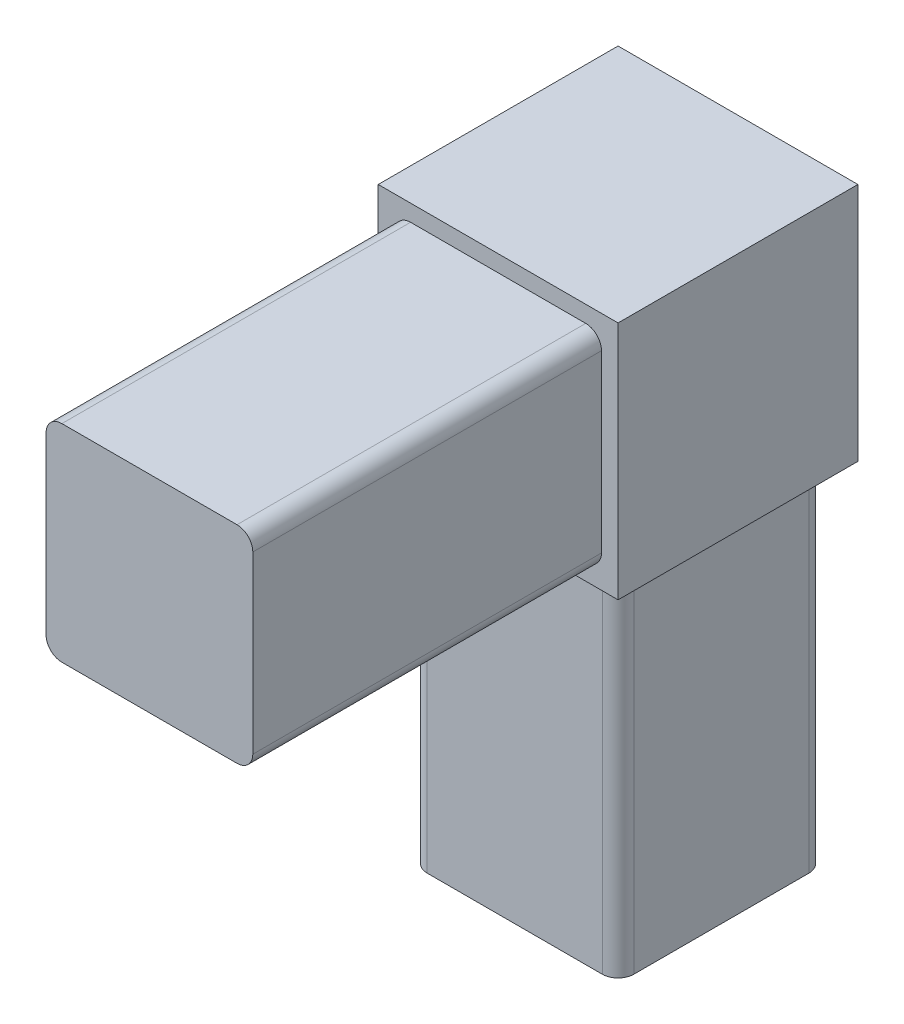
ISO-10303-21;
HEADER;
FILE_DESCRIPTION(('STEP AP214'),'2;1');
FILE_NAME('part.step','',(''),(''),'','','');
FILE_SCHEMA(('AUTOMOTIVE_DESIGN { 1 0 10303 214 1 1 1 1 }'));
ENDSEC;
DATA;
#1=APPLICATION_CONTEXT('core data for automotive mechanical design processes');
#2=APPLICATION_PROTOCOL_DEFINITION('international standard','automotive_design',2000,#1);
#3=PRODUCT_CONTEXT('',#1,'mechanical');
#4=PRODUCT('Part','Part','',(#3));
#5=PRODUCT_RELATED_PRODUCT_CATEGORY('part','',(#4));
#6=PRODUCT_DEFINITION_FORMATION('','',#4);
#7=PRODUCT_DEFINITION_CONTEXT('part definition',#1,'design');
#8=PRODUCT_DEFINITION('design','',#6,#7);
#9=PRODUCT_DEFINITION_SHAPE('','',#8);
#10=(LENGTH_UNIT() NAMED_UNIT(*) SI_UNIT(.MILLI.,.METRE.));
#11=(NAMED_UNIT(*) PLANE_ANGLE_UNIT() SI_UNIT($,.RADIAN.));
#12=(NAMED_UNIT(*) SI_UNIT($,.STERADIAN.) SOLID_ANGLE_UNIT());
#13=UNCERTAINTY_MEASURE_WITH_UNIT(LENGTH_MEASURE(1.E-05),#10,'distance_accuracy_value','');
#14=(GEOMETRIC_REPRESENTATION_CONTEXT(3) GLOBAL_UNCERTAINTY_ASSIGNED_CONTEXT((#13)) GLOBAL_UNIT_ASSIGNED_CONTEXT((#10,
#11,#12)) REPRESENTATION_CONTEXT('',''));
#15=CARTESIAN_POINT('',(0.,0.,0.));
#16=DIRECTION('',(0.,0.,1.));
#17=DIRECTION('',(1.,0.,0.));
#18=AXIS2_PLACEMENT_3D('',#15,#16,#17);
#19=CARTESIAN_POINT('',(-9.652,47.371,9.652));
#20=DIRECTION('',(0.,0.,-1.));
#21=DIRECTION('',(-1.,0.,0.));
#22=AXIS2_PLACEMENT_3D('',#19,#20,#21);
#23=PLANE('',#22);
#24=DIRECTION('',(1.,0.,0.));
#25=VECTOR('',#24,1.);
#26=CARTESIAN_POINT('',(-9.652,28.067,9.652));
#27=LINE('',#26,#25);
#28=CARTESIAN_POINT('',(-9.652,28.067,9.652));
#29=VERTEX_POINT('',#28);
#30=CARTESIAN_POINT('',(9.652,28.067,9.652));
#31=VERTEX_POINT('',#30);
#32=EDGE_CURVE('E192',#29,#31,#27,.T.);
#33=ORIENTED_EDGE('',*,*,#32,.T.);
#34=DIRECTION('',(0.,-1.,0.));
#35=VECTOR('',#34,1.);
#36=CARTESIAN_POINT('',(9.652,47.371,9.652));
#37=LINE('',#36,#35);
#38=CARTESIAN_POINT('',(9.652,47.371,9.652));
#39=VERTEX_POINT('',#38);
#40=EDGE_CURVE('E412',#39,#31,#37,.T.);
#41=ORIENTED_EDGE('',*,*,#40,.F.);
#42=DIRECTION('',(1.,0.,0.));
#43=VECTOR('',#42,1.);
#44=CARTESIAN_POINT('',(-9.652,47.371,9.652));
#45=LINE('',#44,#43);
#46=CARTESIAN_POINT('',(-9.652,47.371,9.652));
#47=VERTEX_POINT('',#46);
#48=EDGE_CURVE('E188',#47,#39,#45,.T.);
#49=ORIENTED_EDGE('',*,*,#48,.F.);
#50=DIRECTION('',(0.,-1.,0.));
#51=VECTOR('',#50,1.);
#52=CARTESIAN_POINT('',(-9.652,47.371,9.652));
#53=LINE('',#52,#51);
#54=EDGE_CURVE('E202',#47,#29,#53,.T.);
#55=ORIENTED_EDGE('',*,*,#54,.T.);
#56=EDGE_LOOP('',(#33,#41,#49,#55));
#57=FACE_BOUND('',#56,.T.);
#58=DIRECTION('',(0.,1.,0.));
#59=VECTOR('',#58,1.);
#60=CARTESIAN_POINT('',(8.3185,29.4005,9.652));
#61=LINE('',#60,#59);
#62=CARTESIAN_POINT('',(8.3185,30.6705,9.652));
#63=VERTEX_POINT('',#62);
#64=CARTESIAN_POINT('',(8.3185,44.7675,9.652));
#65=VERTEX_POINT('',#64);
#66=EDGE_CURVE('E399',#63,#65,#61,.T.);
#67=ORIENTED_EDGE('',*,*,#66,.F.);
#68=CARTESIAN_POINT('',(7.0485,30.6705,9.652));
#69=DIRECTION('',(0.,0.,-1.));
#70=DIRECTION('',(-1.,0.,0.));
#71=AXIS2_PLACEMENT_3D('',#68,#69,#70);
#72=CIRCLE('',#71,1.27);
#73=CARTESIAN_POINT('',(7.0485,29.4005,9.652));
#74=VERTEX_POINT('',#73);
#75=EDGE_CURVE('E280',#63,#74,#72,.T.);
#76=ORIENTED_EDGE('',*,*,#75,.T.);
#77=DIRECTION('',(1.,0.,0.));
#78=VECTOR('',#77,1.);
#79=CARTESIAN_POINT('',(-8.3185,29.4005,9.652));
#80=LINE('',#79,#78);
#81=CARTESIAN_POINT('',(-7.0485,29.4005,9.652));
#82=VERTEX_POINT('',#81);
#83=EDGE_CURVE('E407',#82,#74,#80,.T.);
#84=ORIENTED_EDGE('',*,*,#83,.F.);
#85=CARTESIAN_POINT('',(-7.0485,30.6705,9.652));
#86=DIRECTION('',(0.,0.,-1.));
#87=DIRECTION('',(-1.,0.,0.));
#88=AXIS2_PLACEMENT_3D('',#85,#86,#87);
#89=CIRCLE('',#88,1.27);
#90=CARTESIAN_POINT('',(-8.3185,30.6705,9.652));
#91=VERTEX_POINT('',#90);
#92=EDGE_CURVE('E284',#82,#91,#89,.T.);
#93=ORIENTED_EDGE('',*,*,#92,.T.);
#94=DIRECTION('',(0.,-1.,0.));
#95=VECTOR('',#94,1.);
#96=CARTESIAN_POINT('',(-8.3185,29.4005,9.652));
#97=LINE('',#96,#95);
#98=CARTESIAN_POINT('',(-8.3185,44.7675,9.652));
#99=VERTEX_POINT('',#98);
#100=EDGE_CURVE('E405',#99,#91,#97,.T.);
#101=ORIENTED_EDGE('',*,*,#100,.F.);
#102=CARTESIAN_POINT('',(-7.0485,44.7675,9.652));
#103=DIRECTION('',(0.,0.,-1.));
#104=DIRECTION('',(-1.,0.,0.));
#105=AXIS2_PLACEMENT_3D('',#102,#103,#104);
#106=CIRCLE('',#105,1.27);
#107=CARTESIAN_POINT('',(-7.0485,46.0375,9.652));
#108=VERTEX_POINT('',#107);
#109=EDGE_CURVE('E282',#99,#108,#106,.T.);
#110=ORIENTED_EDGE('',*,*,#109,.T.);
#111=DIRECTION('',(-1.,0.,0.));
#112=VECTOR('',#111,1.);
#113=CARTESIAN_POINT('',(-8.3185,46.0375,9.652));
#114=LINE('',#113,#112);
#115=CARTESIAN_POINT('',(7.0485,46.0375,9.652));
#116=VERTEX_POINT('',#115);
#117=EDGE_CURVE('E402',#116,#108,#114,.T.);
#118=ORIENTED_EDGE('',*,*,#117,.F.);
#119=CARTESIAN_POINT('',(7.0485,44.7675,9.652));
#120=DIRECTION('',(0.,0.,-1.));
#121=DIRECTION('',(-1.,0.,0.));
#122=AXIS2_PLACEMENT_3D('',#119,#120,#121);
#123=CIRCLE('',#122,1.27);
#124=EDGE_CURVE('E278',#116,#65,#123,.T.);
#125=ORIENTED_EDGE('',*,*,#124,.T.);
#126=EDGE_LOOP('',(#67,#76,#84,#93,#101,#110,#118,#125));
#127=FACE_BOUND('',#126,.T.);
#128=ADVANCED_FACE('F35',(#57,#127),#23,.F.);
#129=CARTESIAN_POINT('',(8.3185,28.067,-8.3185));
#130=DIRECTION('',(-1.,0.,0.));
#131=DIRECTION('',(0.,0.,1.));
#132=AXIS2_PLACEMENT_3D('',#129,#130,#131);
#133=PLANE('',#132);
#134=DIRECTION('',(0.,0.,-1.));
#135=VECTOR('',#134,1.);
#136=CARTESIAN_POINT('',(8.3185,28.067,-8.3185));
#137=LINE('',#136,#135);
#138=CARTESIAN_POINT('',(8.3185,28.067,7.0485));
#139=VERTEX_POINT('',#138);
#140=CARTESIAN_POINT('',(8.3185,28.067,-7.0485));
#141=VERTEX_POINT('',#140);
#142=EDGE_CURVE('E206',#139,#141,#137,.T.);
#143=ORIENTED_EDGE('',*,*,#142,.F.);
#144=DIRECTION('',(0.,-1.,0.));
#145=VECTOR('',#144,1.);
#146=CARTESIAN_POINT('',(8.3185,28.067,7.0485));
#147=LINE('',#146,#145);
#148=CARTESIAN_POINT('',(8.3185,0.,7.0485));
#149=VERTEX_POINT('',#148);
#150=EDGE_CURVE('E271',#139,#149,#147,.T.);
#151=ORIENTED_EDGE('',*,*,#150,.T.);
#152=DIRECTION('',(0.,0.,-1.));
#153=VECTOR('',#152,1.);
#154=CARTESIAN_POINT('',(8.3185,0.,-8.3185));
#155=LINE('',#154,#153);
#156=CARTESIAN_POINT('',(8.3185,0.,-7.0485));
#157=VERTEX_POINT('',#156);
#158=EDGE_CURVE('E197',#149,#157,#155,.T.);
#159=ORIENTED_EDGE('',*,*,#158,.T.);
#160=DIRECTION('',(0.,-1.,0.));
#161=VECTOR('',#160,1.);
#162=CARTESIAN_POINT('',(8.3185,28.067,-7.0485));
#163=LINE('',#162,#161);
#164=EDGE_CURVE('E269',#157,#141,#163,.F.);
#165=ORIENTED_EDGE('',*,*,#164,.T.);
#166=EDGE_LOOP('',(#143,#151,#159,#165));
#167=FACE_BOUND('',#166,.T.);
#168=ADVANCED_FACE('F311',(#167),#133,.F.);
#169=CARTESIAN_POINT('',(-8.3185,28.067,-8.3185));
#170=DIRECTION('',(0.,0.,1.));
#171=DIRECTION('',(1.,0.,0.));
#172=AXIS2_PLACEMENT_3D('',#169,#170,#171);
#173=PLANE('',#172);
#174=DIRECTION('',(-1.,0.,0.));
#175=VECTOR('',#174,1.);
#176=CARTESIAN_POINT('',(-8.3185,0.,-8.3185));
#177=LINE('',#176,#175);
#178=CARTESIAN_POINT('',(7.0485,0.,-8.3185));
#179=VERTEX_POINT('',#178);
#180=CARTESIAN_POINT('',(-7.0485,0.,-8.3185));
#181=VERTEX_POINT('',#180);
#182=EDGE_CURVE('E200',#179,#181,#177,.T.);
#183=ORIENTED_EDGE('',*,*,#182,.T.);
#184=DIRECTION('',(0.,-1.,0.));
#185=VECTOR('',#184,1.);
#186=CARTESIAN_POINT('',(-7.0485,28.067,-8.3185));
#187=LINE('',#186,#185);
#188=CARTESIAN_POINT('',(-7.0485,28.067,-8.3185));
#189=VERTEX_POINT('',#188);
#190=EDGE_CURVE('E50',#181,#189,#187,.F.);
#191=ORIENTED_EDGE('',*,*,#190,.T.);
#192=DIRECTION('',(-1.,0.,0.));
#193=VECTOR('',#192,1.);
#194=CARTESIAN_POINT('',(-8.3185,28.067,-8.3185));
#195=LINE('',#194,#193);
#196=CARTESIAN_POINT('',(7.0485,28.067,-8.3185));
#197=VERTEX_POINT('',#196);
#198=EDGE_CURVE('E208',#197,#189,#195,.T.);
#199=ORIENTED_EDGE('',*,*,#198,.F.);
#200=DIRECTION('',(0.,-1.,0.));
#201=VECTOR('',#200,1.);
#202=CARTESIAN_POINT('',(7.0485,28.067,-8.3185));
#203=LINE('',#202,#201);
#204=EDGE_CURVE('E274',#197,#179,#203,.T.);
#205=ORIENTED_EDGE('',*,*,#204,.T.);
#206=EDGE_LOOP('',(#183,#191,#199,#205));
#207=FACE_BOUND('',#206,.T.);
#208=ADVANCED_FACE('F304',(#207),#173,.F.);
#209=CARTESIAN_POINT('',(-8.3185,28.067,-8.3185));
#210=DIRECTION('',(1.,0.,0.));
#211=DIRECTION('',(0.,0.,-1.));
#212=AXIS2_PLACEMENT_3D('',#209,#210,#211);
#213=PLANE('',#212);
#214=DIRECTION('',(0.,0.,1.));
#215=VECTOR('',#214,1.);
#216=CARTESIAN_POINT('',(-8.3185,0.,-8.3185));
#217=LINE('',#216,#215);
#218=CARTESIAN_POINT('',(-8.3185,0.,-7.0485));
#219=VERTEX_POINT('',#218);
#220=CARTESIAN_POINT('',(-8.3185,0.,7.0485));
#221=VERTEX_POINT('',#220);
#222=EDGE_CURVE('E219',#219,#221,#217,.T.);
#223=ORIENTED_EDGE('',*,*,#222,.T.);
#224=DIRECTION('',(0.,-1.,0.));
#225=VECTOR('',#224,1.);
#226=CARTESIAN_POINT('',(-8.3185,28.067,7.0485));
#227=LINE('',#226,#225);
#228=CARTESIAN_POINT('',(-8.3185,28.067,7.0485));
#229=VERTEX_POINT('',#228);
#230=EDGE_CURVE('E267',#221,#229,#227,.F.);
#231=ORIENTED_EDGE('',*,*,#230,.T.);
#232=DIRECTION('',(0.,0.,1.));
#233=VECTOR('',#232,1.);
#234=CARTESIAN_POINT('',(-8.3185,28.067,-8.3185));
#235=LINE('',#234,#233);
#236=CARTESIAN_POINT('',(-8.3185,28.067,-7.0485));
#237=VERTEX_POINT('',#236);
#238=EDGE_CURVE('E211',#237,#229,#235,.T.);
#239=ORIENTED_EDGE('',*,*,#238,.F.);
#240=DIRECTION('',(0.,-1.,0.));
#241=VECTOR('',#240,1.);
#242=CARTESIAN_POINT('',(-8.3185,28.067,-7.0485));
#243=LINE('',#242,#241);
#244=EDGE_CURVE('E264',#237,#219,#243,.T.);
#245=ORIENTED_EDGE('',*,*,#244,.T.);
#246=EDGE_LOOP('',(#223,#231,#239,#245));
#247=FACE_BOUND('',#246,.T.);
#248=ADVANCED_FACE('F296',(#247),#213,.F.);
#249=CARTESIAN_POINT('',(-8.3185,28.067,8.3185));
#250=DIRECTION('',(0.,0.,-1.));
#251=DIRECTION('',(-1.,0.,0.));
#252=AXIS2_PLACEMENT_3D('',#249,#250,#251);
#253=PLANE('',#252);
#254=DIRECTION('',(1.,0.,0.));
#255=VECTOR('',#254,1.);
#256=CARTESIAN_POINT('',(-8.3185,28.067,8.3185));
#257=LINE('',#256,#255);
#258=CARTESIAN_POINT('',(-7.0485,28.067,8.3185));
#259=VERTEX_POINT('',#258);
#260=CARTESIAN_POINT('',(7.0485,28.067,8.3185));
#261=VERTEX_POINT('',#260);
#262=EDGE_CURVE('E214',#259,#261,#257,.T.);
#263=ORIENTED_EDGE('',*,*,#262,.F.);
#264=DIRECTION('',(0.,-1.,0.));
#265=VECTOR('',#264,1.);
#266=CARTESIAN_POINT('',(-7.0485,28.067,8.3185));
#267=LINE('',#266,#265);
#268=CARTESIAN_POINT('',(-7.0485,0.,8.3185));
#269=VERTEX_POINT('',#268);
#270=EDGE_CURVE('E253',#259,#269,#267,.T.);
#271=ORIENTED_EDGE('',*,*,#270,.T.);
#272=DIRECTION('',(1.,0.,0.));
#273=VECTOR('',#272,1.);
#274=CARTESIAN_POINT('',(-8.3185,0.,8.3185));
#275=LINE('',#274,#273);
#276=CARTESIAN_POINT('',(7.0485,0.,8.3185));
#277=VERTEX_POINT('',#276);
#278=EDGE_CURVE('E209',#269,#277,#275,.T.);
#279=ORIENTED_EDGE('',*,*,#278,.T.);
#280=DIRECTION('',(0.,-1.,0.));
#281=VECTOR('',#280,1.);
#282=CARTESIAN_POINT('',(7.0485,28.067,8.3185));
#283=LINE('',#282,#281);
#284=EDGE_CURVE('E251',#277,#261,#283,.F.);
#285=ORIENTED_EDGE('',*,*,#284,.T.);
#286=EDGE_LOOP('',(#263,#271,#279,#285));
#287=FACE_BOUND('',#286,.T.);
#288=ADVANCED_FACE('F319',(#287),#253,.F.);
#289=CARTESIAN_POINT('',(0.,0.,0.));
#290=DIRECTION('',(0.,1.,0.));
#291=DIRECTION('',(0.,0.,1.));
#292=AXIS2_PLACEMENT_3D('',#289,#290,#291);
#293=PLANE('',#292);
#294=ORIENTED_EDGE('',*,*,#278,.F.);
#295=CARTESIAN_POINT('',(-7.0485,0.,7.0485));
#296=DIRECTION('',(0.,1.,0.));
#297=DIRECTION('',(0.,0.,1.));
#298=AXIS2_PLACEMENT_3D('',#295,#296,#297);
#299=CIRCLE('',#298,1.27);
#300=EDGE_CURVE('E262',#269,#221,#299,.F.);
#301=ORIENTED_EDGE('',*,*,#300,.T.);
#302=ORIENTED_EDGE('',*,*,#222,.F.);
#303=CARTESIAN_POINT('',(-7.0485,0.,-7.0485));
#304=DIRECTION('',(0.,1.,0.));
#305=DIRECTION('',(0.,0.,1.));
#306=AXIS2_PLACEMENT_3D('',#303,#304,#305);
#307=CIRCLE('',#306,1.27);
#308=EDGE_CURVE('E258',#219,#181,#307,.F.);
#309=ORIENTED_EDGE('',*,*,#308,.T.);
#310=ORIENTED_EDGE('',*,*,#182,.F.);
#311=CARTESIAN_POINT('',(7.0485,0.,-7.0485));
#312=DIRECTION('',(0.,1.,0.));
#313=DIRECTION('',(0.,0.,1.));
#314=AXIS2_PLACEMENT_3D('',#311,#312,#313);
#315=CIRCLE('',#314,1.27);
#316=EDGE_CURVE('E256',#179,#157,#315,.F.);
#317=ORIENTED_EDGE('',*,*,#316,.T.);
#318=ORIENTED_EDGE('',*,*,#158,.F.);
#319=CARTESIAN_POINT('',(7.0485,0.,7.0485));
#320=DIRECTION('',(0.,1.,0.));
#321=DIRECTION('',(0.,0.,1.));
#322=AXIS2_PLACEMENT_3D('',#319,#320,#321);
#323=CIRCLE('',#322,1.27);
#324=EDGE_CURVE('E260',#149,#277,#323,.F.);
#325=ORIENTED_EDGE('',*,*,#324,.T.);
#326=EDGE_LOOP('',(#294,#301,#302,#309,#310,#317,#318,#325));
#327=FACE_BOUND('',#326,.T.);
#328=ADVANCED_FACE('F303',(#327),#293,.F.);
#329=CARTESIAN_POINT('',(0.,28.067,0.));
#330=DIRECTION('',(0.,-1.,0.));
#331=DIRECTION('',(0.,0.,-1.));
#332=AXIS2_PLACEMENT_3D('',#329,#330,#331);
#333=PLANE('',#332);
#334=DIRECTION('',(0.,0.,-1.));
#335=VECTOR('',#334,1.);
#336=CARTESIAN_POINT('',(9.652,28.067,9.652));
#337=LINE('',#336,#335);
#338=CARTESIAN_POINT('',(9.652,28.067,-9.652));
#339=VERTEX_POINT('',#338);
#340=EDGE_CURVE('E196',#31,#339,#337,.T.);
#341=ORIENTED_EDGE('',*,*,#340,.F.);
#342=ORIENTED_EDGE('',*,*,#32,.F.);
#343=DIRECTION('',(0.,0.,1.));
#344=VECTOR('',#343,1.);
#345=CARTESIAN_POINT('',(-9.652,28.067,9.652));
#346=LINE('',#345,#344);
#347=CARTESIAN_POINT('',(-9.652,28.067,-9.652));
#348=VERTEX_POINT('',#347);
#349=EDGE_CURVE('E416',#348,#29,#346,.T.);
#350=ORIENTED_EDGE('',*,*,#349,.F.);
#351=DIRECTION('',(-1.,0.,0.));
#352=VECTOR('',#351,1.);
#353=CARTESIAN_POINT('',(-9.652,28.067,-9.652));
#354=LINE('',#353,#352);
#355=EDGE_CURVE('E414',#339,#348,#354,.T.);
#356=ORIENTED_EDGE('',*,*,#355,.F.);
#357=EDGE_LOOP('',(#341,#342,#350,#356));
#358=FACE_BOUND('',#357,.T.);
#359=ORIENTED_EDGE('',*,*,#262,.T.);
#360=CARTESIAN_POINT('',(7.0485,28.067,7.0485));
#361=DIRECTION('',(0.,-1.,0.));
#362=DIRECTION('',(0.,0.,-1.));
#363=AXIS2_PLACEMENT_3D('',#360,#361,#362);
#364=CIRCLE('',#363,1.27);
#365=EDGE_CURVE('E288',#261,#139,#364,.F.);
#366=ORIENTED_EDGE('',*,*,#365,.T.);
#367=ORIENTED_EDGE('',*,*,#142,.T.);
#368=CARTESIAN_POINT('',(7.0485,28.067,-7.0485));
#369=DIRECTION('',(0.,-1.,0.));
#370=DIRECTION('',(0.,0.,-1.));
#371=AXIS2_PLACEMENT_3D('',#368,#369,#370);
#372=CIRCLE('',#371,1.27);
#373=EDGE_CURVE('E11',#141,#197,#372,.F.);
#374=ORIENTED_EDGE('',*,*,#373,.T.);
#375=ORIENTED_EDGE('',*,*,#198,.T.);
#376=CARTESIAN_POINT('',(-7.0485,28.067,-7.0485));
#377=DIRECTION('',(0.,-1.,0.));
#378=DIRECTION('',(0.,0.,-1.));
#379=AXIS2_PLACEMENT_3D('',#376,#377,#378);
#380=CIRCLE('',#379,1.27);
#381=EDGE_CURVE('E43',#189,#237,#380,.F.);
#382=ORIENTED_EDGE('',*,*,#381,.T.);
#383=ORIENTED_EDGE('',*,*,#238,.T.);
#384=CARTESIAN_POINT('',(-7.0485,28.067,7.0485));
#385=DIRECTION('',(0.,-1.,0.));
#386=DIRECTION('',(0.,0.,-1.));
#387=AXIS2_PLACEMENT_3D('',#384,#385,#386);
#388=CIRCLE('',#387,1.27);
#389=EDGE_CURVE('E286',#229,#259,#388,.F.);
#390=ORIENTED_EDGE('',*,*,#389,.T.);
#391=EDGE_LOOP('',(#359,#366,#367,#374,#375,#382,#383,#390));
#392=FACE_BOUND('',#391,.T.);
#393=ADVANCED_FACE('F291',(#358,#392),#333,.T.);
#394=CARTESIAN_POINT('',(9.652,47.371,9.652));
#395=DIRECTION('',(-1.,0.,0.));
#396=DIRECTION('',(0.,0.,1.));
#397=AXIS2_PLACEMENT_3D('',#394,#395,#396);
#398=PLANE('',#397);
#399=ORIENTED_EDGE('',*,*,#340,.T.);
#400=DIRECTION('',(0.,-1.,0.));
#401=VECTOR('',#400,1.);
#402=CARTESIAN_POINT('',(9.652,47.371,-9.652));
#403=LINE('',#402,#401);
#404=CARTESIAN_POINT('',(9.652,47.371,-9.652));
#405=VERTEX_POINT('',#404);
#406=EDGE_CURVE('E176',#405,#339,#403,.T.);
#407=ORIENTED_EDGE('',*,*,#406,.F.);
#408=DIRECTION('',(0.,0.,-1.));
#409=VECTOR('',#408,1.);
#410=CARTESIAN_POINT('',(9.652,47.371,9.652));
#411=LINE('',#410,#409);
#412=EDGE_CURVE('E183',#39,#405,#411,.T.);
#413=ORIENTED_EDGE('',*,*,#412,.F.);
#414=ORIENTED_EDGE('',*,*,#40,.T.);
#415=EDGE_LOOP('',(#399,#407,#413,#414));
#416=FACE_BOUND('',#415,.T.);
#417=ADVANCED_FACE('F194',(#416),#398,.F.);
#418=CARTESIAN_POINT('',(-9.652,47.371,-9.652));
#419=DIRECTION('',(0.,0.,1.));
#420=DIRECTION('',(1.,0.,0.));
#421=AXIS2_PLACEMENT_3D('',#418,#419,#420);
#422=PLANE('',#421);
#423=ORIENTED_EDGE('',*,*,#355,.T.);
#424=DIRECTION('',(0.,-1.,0.));
#425=VECTOR('',#424,1.);
#426=CARTESIAN_POINT('',(-9.652,47.371,-9.652));
#427=LINE('',#426,#425);
#428=CARTESIAN_POINT('',(-9.652,47.371,-9.652));
#429=VERTEX_POINT('',#428);
#430=EDGE_CURVE('E179',#429,#348,#427,.T.);
#431=ORIENTED_EDGE('',*,*,#430,.F.);
#432=DIRECTION('',(-1.,0.,0.));
#433=VECTOR('',#432,1.);
#434=CARTESIAN_POINT('',(-9.652,47.371,-9.652));
#435=LINE('',#434,#433);
#436=EDGE_CURVE('E172',#405,#429,#435,.T.);
#437=ORIENTED_EDGE('',*,*,#436,.F.);
#438=ORIENTED_EDGE('',*,*,#406,.T.);
#439=EDGE_LOOP('',(#423,#431,#437,#438));
#440=FACE_BOUND('',#439,.T.);
#441=ADVANCED_FACE('F174',(#440),#422,.F.);
#442=CARTESIAN_POINT('',(-9.652,47.371,9.652));
#443=DIRECTION('',(1.,0.,0.));
#444=DIRECTION('',(0.,0.,-1.));
#445=AXIS2_PLACEMENT_3D('',#442,#443,#444);
#446=PLANE('',#445);
#447=ORIENTED_EDGE('',*,*,#349,.T.);
#448=ORIENTED_EDGE('',*,*,#54,.F.);
#449=DIRECTION('',(0.,0.,1.));
#450=VECTOR('',#449,1.);
#451=CARTESIAN_POINT('',(-9.652,47.371,9.652));
#452=LINE('',#451,#450);
#453=EDGE_CURVE('E182',#429,#47,#452,.T.);
#454=ORIENTED_EDGE('',*,*,#453,.F.);
#455=ORIENTED_EDGE('',*,*,#430,.T.);
#456=EDGE_LOOP('',(#447,#448,#454,#455));
#457=FACE_BOUND('',#456,.T.);
#458=ADVANCED_FACE('F345',(#457),#446,.F.);
#459=CARTESIAN_POINT('',(0.,47.371,0.));
#460=DIRECTION('',(0.,-1.,0.));
#461=DIRECTION('',(0.,0.,-1.));
#462=AXIS2_PLACEMENT_3D('',#459,#460,#461);
#463=PLANE('',#462);
#464=ORIENTED_EDGE('',*,*,#412,.T.);
#465=ORIENTED_EDGE('',*,*,#436,.T.);
#466=ORIENTED_EDGE('',*,*,#453,.T.);
#467=ORIENTED_EDGE('',*,*,#48,.T.);
#468=EDGE_LOOP('',(#464,#465,#466,#467));
#469=FACE_BOUND('',#468,.T.);
#470=ADVANCED_FACE('F186',(#469),#463,.F.);
#471=CARTESIAN_POINT('',(8.3185,29.4005,37.719));
#472=DIRECTION('',(-1.,0.,0.));
#473=DIRECTION('',(0.,0.,1.));
#474=AXIS2_PLACEMENT_3D('',#471,#472,#473);
#475=PLANE('',#474);
#476=ORIENTED_EDGE('',*,*,#66,.T.);
#477=DIRECTION('',(0.,0.,-1.));
#478=VECTOR('',#477,1.);
#479=CARTESIAN_POINT('',(8.3185,44.7675,37.719));
#480=LINE('',#479,#478);
#481=CARTESIAN_POINT('',(8.3185,44.7675,37.719));
#482=VERTEX_POINT('',#481);
#483=EDGE_CURVE('E231',#65,#482,#480,.F.);
#484=ORIENTED_EDGE('',*,*,#483,.T.);
#485=DIRECTION('',(0.,1.,0.));
#486=VECTOR('',#485,1.);
#487=CARTESIAN_POINT('',(8.3185,29.4005,37.719));
#488=LINE('',#487,#486);
#489=CARTESIAN_POINT('',(8.3185,30.6705,37.719));
#490=VERTEX_POINT('',#489);
#491=EDGE_CURVE('E395',#490,#482,#488,.T.);
#492=ORIENTED_EDGE('',*,*,#491,.F.);
#493=DIRECTION('',(0.,0.,-1.));
#494=VECTOR('',#493,1.);
#495=CARTESIAN_POINT('',(8.3185,30.6705,37.719));
#496=LINE('',#495,#494);
#497=EDGE_CURVE('E228',#490,#63,#496,.T.);
#498=ORIENTED_EDGE('',*,*,#497,.T.);
#499=EDGE_LOOP('',(#476,#484,#492,#498));
#500=FACE_BOUND('',#499,.T.);
#501=ADVANCED_FACE('F447',(#500),#475,.F.);
#502=CARTESIAN_POINT('',(-8.3185,46.0375,37.719));
#503=DIRECTION('',(0.,-1.,0.));
#504=DIRECTION('',(0.,0.,-1.));
#505=AXIS2_PLACEMENT_3D('',#502,#503,#504);
#506=PLANE('',#505);
#507=DIRECTION('',(-1.,0.,0.));
#508=VECTOR('',#507,1.);
#509=CARTESIAN_POINT('',(-8.3185,46.0375,37.719));
#510=LINE('',#509,#508);
#511=CARTESIAN_POINT('',(7.0485,46.0375,37.719));
#512=VERTEX_POINT('',#511);
#513=CARTESIAN_POINT('',(-7.0485,46.0375,37.719));
#514=VERTEX_POINT('',#513);
#515=EDGE_CURVE('E385',#512,#514,#510,.T.);
#516=ORIENTED_EDGE('',*,*,#515,.F.);
#517=DIRECTION('',(0.,0.,-1.));
#518=VECTOR('',#517,1.);
#519=CARTESIAN_POINT('',(7.0485,46.0375,37.719));
#520=LINE('',#519,#518);
#521=EDGE_CURVE('E225',#512,#116,#520,.T.);
#522=ORIENTED_EDGE('',*,*,#521,.T.);
#523=ORIENTED_EDGE('',*,*,#117,.T.);
#524=DIRECTION('',(0.,0.,-1.));
#525=VECTOR('',#524,1.);
#526=CARTESIAN_POINT('',(-7.0485,46.0375,37.719));
#527=LINE('',#526,#525);
#528=EDGE_CURVE('E216',#108,#514,#527,.F.);
#529=ORIENTED_EDGE('',*,*,#528,.T.);
#530=EDGE_LOOP('',(#516,#522,#523,#529));
#531=FACE_BOUND('',#530,.T.);
#532=ADVANCED_FACE('F453',(#531),#506,.F.);
#533=CARTESIAN_POINT('',(-8.3185,29.4005,37.719));
#534=DIRECTION('',(1.,0.,0.));
#535=DIRECTION('',(0.,0.,-1.));
#536=AXIS2_PLACEMENT_3D('',#533,#534,#535);
#537=PLANE('',#536);
#538=DIRECTION('',(0.,-1.,0.));
#539=VECTOR('',#538,1.);
#540=CARTESIAN_POINT('',(-8.3185,29.4005,37.719));
#541=LINE('',#540,#539);
#542=CARTESIAN_POINT('',(-8.3185,44.7675,37.719));
#543=VERTEX_POINT('',#542);
#544=CARTESIAN_POINT('',(-8.3185,30.6705,37.719));
#545=VERTEX_POINT('',#544);
#546=EDGE_CURVE('E382',#543,#545,#541,.T.);
#547=ORIENTED_EDGE('',*,*,#546,.F.);
#548=DIRECTION('',(0.,0.,-1.));
#549=VECTOR('',#548,1.);
#550=CARTESIAN_POINT('',(-8.3185,44.7675,37.719));
#551=LINE('',#550,#549);
#552=EDGE_CURVE('E248',#543,#99,#551,.T.);
#553=ORIENTED_EDGE('',*,*,#552,.T.);
#554=ORIENTED_EDGE('',*,*,#100,.T.);
#555=DIRECTION('',(0.,0.,-1.));
#556=VECTOR('',#555,1.);
#557=CARTESIAN_POINT('',(-8.3185,30.6705,37.719));
#558=LINE('',#557,#556);
#559=EDGE_CURVE('E246',#91,#545,#558,.F.);
#560=ORIENTED_EDGE('',*,*,#559,.T.);
#561=EDGE_LOOP('',(#547,#553,#554,#560));
#562=FACE_BOUND('',#561,.T.);
#563=ADVANCED_FACE('F387',(#562),#537,.F.);
#564=CARTESIAN_POINT('',(-8.3185,29.4005,37.719));
#565=DIRECTION('',(0.,1.,0.));
#566=DIRECTION('',(0.,0.,1.));
#567=AXIS2_PLACEMENT_3D('',#564,#565,#566);
#568=PLANE('',#567);
#569=ORIENTED_EDGE('',*,*,#83,.T.);
#570=DIRECTION('',(0.,0.,-1.));
#571=VECTOR('',#570,1.);
#572=CARTESIAN_POINT('',(7.0485,29.4005,37.719));
#573=LINE('',#572,#571);
#574=CARTESIAN_POINT('',(7.0485,29.4005,37.719));
#575=VERTEX_POINT('',#574);
#576=EDGE_CURVE('E244',#74,#575,#573,.F.);
#577=ORIENTED_EDGE('',*,*,#576,.T.);
#578=DIRECTION('',(1.,0.,0.));
#579=VECTOR('',#578,1.);
#580=CARTESIAN_POINT('',(-8.3185,29.4005,37.719));
#581=LINE('',#580,#579);
#582=CARTESIAN_POINT('',(-7.0485,29.4005,37.719));
#583=VERTEX_POINT('',#582);
#584=EDGE_CURVE('E391',#583,#575,#581,.T.);
#585=ORIENTED_EDGE('',*,*,#584,.F.);
#586=DIRECTION('',(0.,0.,-1.));
#587=VECTOR('',#586,1.);
#588=CARTESIAN_POINT('',(-7.0485,29.4005,37.719));
#589=LINE('',#588,#587);
#590=EDGE_CURVE('E241',#583,#82,#589,.T.);
#591=ORIENTED_EDGE('',*,*,#590,.T.);
#592=EDGE_LOOP('',(#569,#577,#585,#591));
#593=FACE_BOUND('',#592,.T.);
#594=ADVANCED_FACE('F468',(#593),#568,.F.);
#595=CARTESIAN_POINT('',(0.,0.,37.719));
#596=DIRECTION('',(0.,0.,-1.));
#597=DIRECTION('',(-1.,0.,0.));
#598=AXIS2_PLACEMENT_3D('',#595,#596,#597);
#599=PLANE('',#598);
#600=ORIENTED_EDGE('',*,*,#491,.T.);
#601=CARTESIAN_POINT('',(7.0485,44.7675,37.719));
#602=DIRECTION('',(0.,0.,-1.));
#603=DIRECTION('',(-1.,0.,0.));
#604=AXIS2_PLACEMENT_3D('',#601,#602,#603);
#605=CIRCLE('',#604,1.27);
#606=EDGE_CURVE('E239',#482,#512,#605,.F.);
#607=ORIENTED_EDGE('',*,*,#606,.T.);
#608=ORIENTED_EDGE('',*,*,#515,.T.);
#609=CARTESIAN_POINT('',(-7.0485,44.7675,37.719));
#610=DIRECTION('',(0.,0.,-1.));
#611=DIRECTION('',(-1.,0.,0.));
#612=AXIS2_PLACEMENT_3D('',#609,#610,#611);
#613=CIRCLE('',#612,1.27);
#614=EDGE_CURVE('E235',#514,#543,#613,.F.);
#615=ORIENTED_EDGE('',*,*,#614,.T.);
#616=ORIENTED_EDGE('',*,*,#546,.T.);
#617=CARTESIAN_POINT('',(-7.0485,30.6705,37.719));
#618=DIRECTION('',(0.,0.,-1.));
#619=DIRECTION('',(-1.,0.,0.));
#620=AXIS2_PLACEMENT_3D('',#617,#618,#619);
#621=CIRCLE('',#620,1.27);
#622=EDGE_CURVE('E233',#545,#583,#621,.F.);
#623=ORIENTED_EDGE('',*,*,#622,.T.);
#624=ORIENTED_EDGE('',*,*,#584,.T.);
#625=CARTESIAN_POINT('',(7.0485,30.6705,37.719));
#626=DIRECTION('',(0.,0.,-1.));
#627=DIRECTION('',(-1.,0.,0.));
#628=AXIS2_PLACEMENT_3D('',#625,#626,#627);
#629=CIRCLE('',#628,1.27);
#630=EDGE_CURVE('E237',#575,#490,#629,.F.);
#631=ORIENTED_EDGE('',*,*,#630,.T.);
#632=EDGE_LOOP('',(#600,#607,#608,#615,#616,#623,#624,#631));
#633=FACE_BOUND('',#632,.T.);
#634=ADVANCED_FACE('F365',(#633),#599,.F.);
#635=CARTESIAN_POINT('',(7.0485,44.7675,37.719));
#636=DIRECTION('',(0.,0.,-1.));
#637=DIRECTION('',(-1.,0.,0.));
#638=AXIS2_PLACEMENT_3D('',#635,#636,#637);
#639=CYLINDRICAL_SURFACE('',#638,1.27);
#640=ORIENTED_EDGE('',*,*,#606,.F.);
#641=ORIENTED_EDGE('',*,*,#483,.F.);
#642=ORIENTED_EDGE('',*,*,#124,.F.);
#643=ORIENTED_EDGE('',*,*,#521,.F.);
#644=EDGE_LOOP('',(#640,#641,#642,#643));
#645=FACE_BOUND('',#644,.T.);
#646=ADVANCED_FACE('F361',(#645),#639,.T.);
#647=CARTESIAN_POINT('',(7.0485,30.6705,37.719));
#648=DIRECTION('',(0.,0.,-1.));
#649=DIRECTION('',(-1.,0.,0.));
#650=AXIS2_PLACEMENT_3D('',#647,#648,#649);
#651=CYLINDRICAL_SURFACE('',#650,1.27);
#652=ORIENTED_EDGE('',*,*,#630,.F.);
#653=ORIENTED_EDGE('',*,*,#576,.F.);
#654=ORIENTED_EDGE('',*,*,#75,.F.);
#655=ORIENTED_EDGE('',*,*,#497,.F.);
#656=EDGE_LOOP('',(#652,#653,#654,#655));
#657=FACE_BOUND('',#656,.T.);
#658=ADVANCED_FACE('F364',(#657),#651,.T.);
#659=CARTESIAN_POINT('',(-7.0485,44.7675,37.719));
#660=DIRECTION('',(0.,0.,-1.));
#661=DIRECTION('',(-1.,0.,0.));
#662=AXIS2_PLACEMENT_3D('',#659,#660,#661);
#663=CYLINDRICAL_SURFACE('',#662,1.27);
#664=ORIENTED_EDGE('',*,*,#614,.F.);
#665=ORIENTED_EDGE('',*,*,#528,.F.);
#666=ORIENTED_EDGE('',*,*,#109,.F.);
#667=ORIENTED_EDGE('',*,*,#552,.F.);
#668=EDGE_LOOP('',(#664,#665,#666,#667));
#669=FACE_BOUND('',#668,.T.);
#670=ADVANCED_FACE('F331',(#669),#663,.T.);
#671=CARTESIAN_POINT('',(-7.0485,30.6705,37.719));
#672=DIRECTION('',(0.,0.,-1.));
#673=DIRECTION('',(-1.,0.,0.));
#674=AXIS2_PLACEMENT_3D('',#671,#672,#673);
#675=CYLINDRICAL_SURFACE('',#674,1.27);
#676=ORIENTED_EDGE('',*,*,#622,.F.);
#677=ORIENTED_EDGE('',*,*,#559,.F.);
#678=ORIENTED_EDGE('',*,*,#92,.F.);
#679=ORIENTED_EDGE('',*,*,#590,.F.);
#680=EDGE_LOOP('',(#676,#677,#678,#679));
#681=FACE_BOUND('',#680,.T.);
#682=ADVANCED_FACE('F324',(#681),#675,.T.);
#683=CARTESIAN_POINT('',(-7.0485,28.067,7.0485));
#684=DIRECTION('',(0.,-1.,0.));
#685=DIRECTION('',(0.,0.,-1.));
#686=AXIS2_PLACEMENT_3D('',#683,#684,#685);
#687=CYLINDRICAL_SURFACE('',#686,1.27);
#688=ORIENTED_EDGE('',*,*,#389,.F.);
#689=ORIENTED_EDGE('',*,*,#230,.F.);
#690=ORIENTED_EDGE('',*,*,#300,.F.);
#691=ORIENTED_EDGE('',*,*,#270,.F.);
#692=EDGE_LOOP('',(#688,#689,#690,#691));
#693=FACE_BOUND('',#692,.T.);
#694=ADVANCED_FACE('F322',(#693),#687,.T.);
#695=CARTESIAN_POINT('',(7.0485,28.067,7.0485));
#696=DIRECTION('',(0.,-1.,0.));
#697=DIRECTION('',(0.,0.,-1.));
#698=AXIS2_PLACEMENT_3D('',#695,#696,#697);
#699=CYLINDRICAL_SURFACE('',#698,1.27);
#700=ORIENTED_EDGE('',*,*,#365,.F.);
#701=ORIENTED_EDGE('',*,*,#284,.F.);
#702=ORIENTED_EDGE('',*,*,#324,.F.);
#703=ORIENTED_EDGE('',*,*,#150,.F.);
#704=EDGE_LOOP('',(#700,#701,#702,#703));
#705=FACE_BOUND('',#704,.T.);
#706=ADVANCED_FACE('F315',(#705),#699,.T.);
#707=CARTESIAN_POINT('',(-7.0485,28.067,-7.0485));
#708=DIRECTION('',(0.,-1.,0.));
#709=DIRECTION('',(0.,0.,-1.));
#710=AXIS2_PLACEMENT_3D('',#707,#708,#709);
#711=CYLINDRICAL_SURFACE('',#710,1.27);
#712=ORIENTED_EDGE('',*,*,#381,.F.);
#713=ORIENTED_EDGE('',*,*,#190,.F.);
#714=ORIENTED_EDGE('',*,*,#308,.F.);
#715=ORIENTED_EDGE('',*,*,#244,.F.);
#716=EDGE_LOOP('',(#712,#713,#714,#715));
#717=FACE_BOUND('',#716,.T.);
#718=ADVANCED_FACE('F299',(#717),#711,.T.);
#719=CARTESIAN_POINT('',(7.0485,28.067,-7.0485));
#720=DIRECTION('',(0.,-1.,0.));
#721=DIRECTION('',(0.,0.,-1.));
#722=AXIS2_PLACEMENT_3D('',#719,#720,#721);
#723=CYLINDRICAL_SURFACE('',#722,1.27);
#724=ORIENTED_EDGE('',*,*,#373,.F.);
#725=ORIENTED_EDGE('',*,*,#164,.F.);
#726=ORIENTED_EDGE('',*,*,#316,.F.);
#727=ORIENTED_EDGE('',*,*,#204,.F.);
#728=EDGE_LOOP('',(#724,#725,#726,#727));
#729=FACE_BOUND('',#728,.T.);
#730=ADVANCED_FACE('F37',(#729),#723,.T.);
#731=CLOSED_SHELL('',(#128,#168,#208,#248,#288,#328,#393,#417,#441,#458,#470,#501,#532,#563,
#594,#634,#646,#658,#670,#682,#694,#706,#718,#730));
#732=MANIFOLD_SOLID_BREP('B2',#731);
#733=ADVANCED_BREP_SHAPE_REPRESENTATION('',(#18,#732),#14);
#734=SHAPE_DEFINITION_REPRESENTATION(#9,#733);
ENDSEC;
END-ISO-10303-21;
